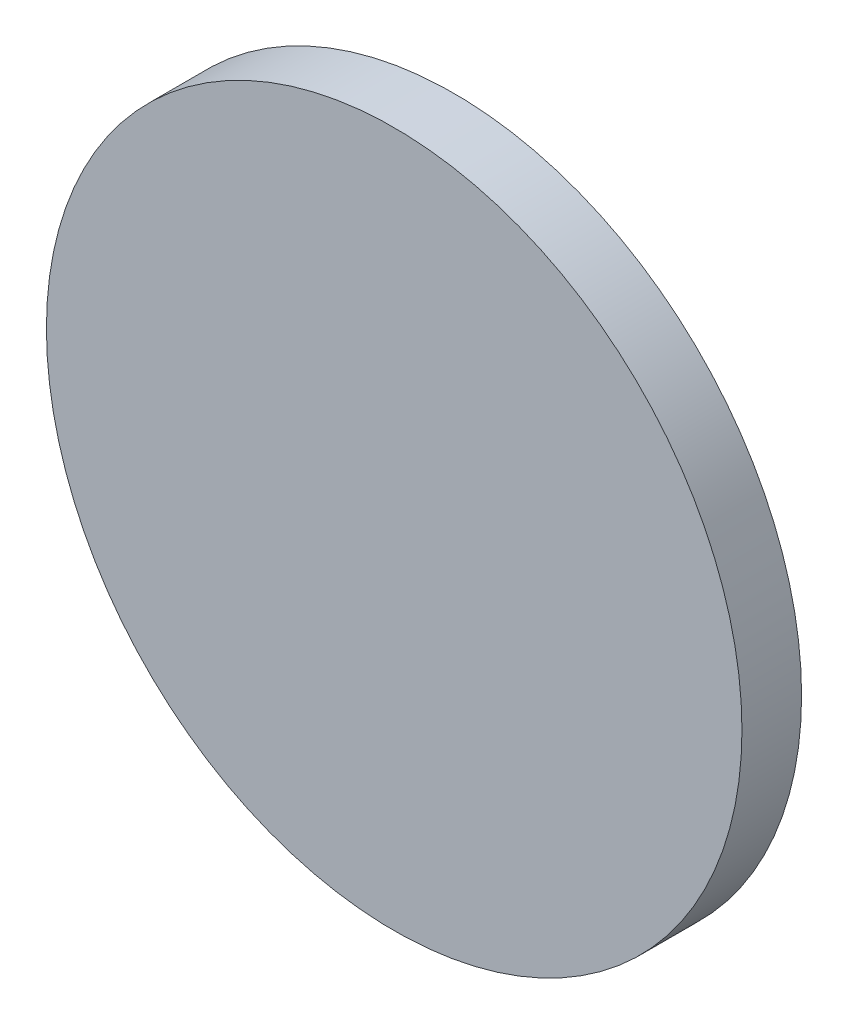
ISO-10303-21;
HEADER;
FILE_DESCRIPTION(('STEP AP214'),'2;1');
FILE_NAME('part.step','',(''),(''),'','','');
FILE_SCHEMA(('AUTOMOTIVE_DESIGN { 1 0 10303 214 1 1 1 1 }'));
ENDSEC;
DATA;
#1=APPLICATION_CONTEXT('core data for automotive mechanical design processes');
#2=APPLICATION_PROTOCOL_DEFINITION('international standard','automotive_design',2000,#1);
#3=PRODUCT_CONTEXT('',#1,'mechanical');
#4=PRODUCT('Part','Part','',(#3));
#5=PRODUCT_RELATED_PRODUCT_CATEGORY('part','',(#4));
#6=PRODUCT_DEFINITION_FORMATION('','',#4);
#7=PRODUCT_DEFINITION_CONTEXT('part definition',#1,'design');
#8=PRODUCT_DEFINITION('design','',#6,#7);
#9=PRODUCT_DEFINITION_SHAPE('','',#8);
#10=(LENGTH_UNIT() NAMED_UNIT(*) SI_UNIT(.MILLI.,.METRE.));
#11=(NAMED_UNIT(*) PLANE_ANGLE_UNIT() SI_UNIT($,.RADIAN.));
#12=(NAMED_UNIT(*) SI_UNIT($,.STERADIAN.) SOLID_ANGLE_UNIT());
#13=UNCERTAINTY_MEASURE_WITH_UNIT(LENGTH_MEASURE(1.E-05),#10,'distance_accuracy_value','');
#14=(GEOMETRIC_REPRESENTATION_CONTEXT(3) GLOBAL_UNCERTAINTY_ASSIGNED_CONTEXT((#13)) GLOBAL_UNIT_ASSIGNED_CONTEXT((#10,
#11,#12)) REPRESENTATION_CONTEXT('',''));
#15=CARTESIAN_POINT('',(0.,0.,0.));
#16=DIRECTION('',(0.,0.,1.));
#17=DIRECTION('',(1.,0.,0.));
#18=AXIS2_PLACEMENT_3D('',#15,#16,#17);
#19=CARTESIAN_POINT('',(10.65,9.818000014875,0.79916));
#20=DIRECTION('',(0.,0.,1.));
#21=DIRECTION('',(1.,0.,0.));
#22=AXIS2_PLACEMENT_3D('',#19,#20,#21);
#23=PLANE('',#22);
#24=CARTESIAN_POINT('',(10.65,9.818000014875,0.79916));
#25=DIRECTION('',(0.,0.,1.));
#26=DIRECTION('',(1.,0.,0.));
#27=AXIS2_PLACEMENT_3D('',#24,#25,#26);
#28=CIRCLE('',#27,0.200024667);
#29=CARTESIAN_POINT('',(10.850024667,9.818000014875,0.79916));
#30=VERTEX_POINT('',#29);
#31=EDGE_CURVE('E18',#30,#30,#28,.F.);
#32=ORIENTED_EDGE('',*,*,#31,.F.);
#33=EDGE_LOOP('',(#32));
#34=FACE_BOUND('',#33,.T.);
#35=ADVANCED_FACE('F15',(#34),#23,.T.);
#36=CARTESIAN_POINT('',(10.65,9.818000014875,0.76487));
#37=DIRECTION('',(0.,0.,1.));
#38=DIRECTION('',(1.,0.,0.));
#39=AXIS2_PLACEMENT_3D('',#36,#37,#38);
#40=CYLINDRICAL_SURFACE('',#39,0.200024667);
#41=ORIENTED_EDGE('',*,*,#31,.T.);
#42=EDGE_LOOP('',(#41));
#43=FACE_BOUND('',#42,.T.);
#44=CARTESIAN_POINT('',(10.65,9.818000014875,0.76487));
#45=DIRECTION('',(0.,0.,1.));
#46=DIRECTION('',(1.,0.,0.));
#47=AXIS2_PLACEMENT_3D('',#44,#45,#46);
#48=CIRCLE('',#47,0.200024667);
#49=CARTESIAN_POINT('',(10.850024667,9.818000014875,0.76487));
#50=VERTEX_POINT('',#49);
#51=EDGE_CURVE('E10',#50,#50,#48,.F.);
#52=ORIENTED_EDGE('',*,*,#51,.F.);
#53=EDGE_LOOP('',(#52));
#54=FACE_BOUND('',#53,.T.);
#55=ADVANCED_FACE('F27',(#43,#54),#40,.T.);
#56=CARTESIAN_POINT('',(10.65,9.818000014875,0.76487));
#57=DIRECTION('',(0.,0.,-1.));
#58=DIRECTION('',(-1.,0.,0.));
#59=AXIS2_PLACEMENT_3D('',#56,#57,#58);
#60=PLANE('',#59);
#61=ORIENTED_EDGE('',*,*,#51,.T.);
#62=EDGE_LOOP('',(#61));
#63=FACE_BOUND('',#62,.T.);
#64=ADVANCED_FACE('F35',(#63),#60,.T.);
#65=CLOSED_SHELL('',(#35,#55,#64));
#66=MANIFOLD_SOLID_BREP('B1',#65);
#67=ADVANCED_BREP_SHAPE_REPRESENTATION('',(#18,#66),#14);
#68=SHAPE_DEFINITION_REPRESENTATION(#9,#67);
ENDSEC;
END-ISO-10303-21;
